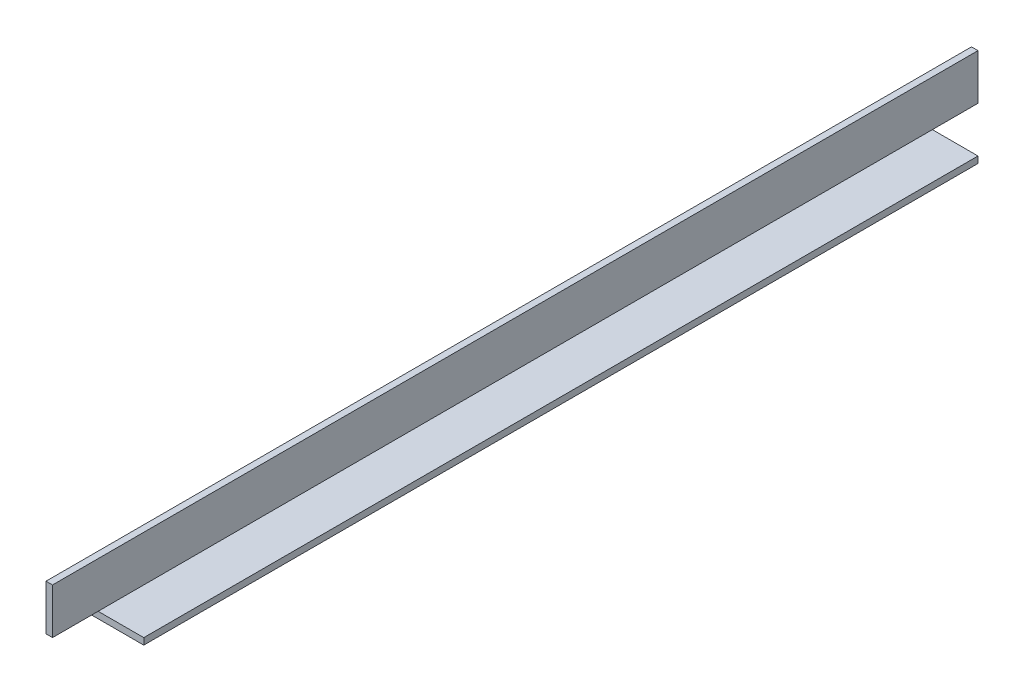
ISO-10303-21;
HEADER;
FILE_DESCRIPTION(('STEP AP214'),'2;1');
FILE_NAME('part.step','',(''),(''),'','','');
FILE_SCHEMA(('AUTOMOTIVE_DESIGN { 1 0 10303 214 1 1 1 1 }'));
ENDSEC;
DATA;
#1=APPLICATION_CONTEXT('core data for automotive mechanical design processes');
#2=APPLICATION_PROTOCOL_DEFINITION('international standard','automotive_design',2000,#1);
#3=PRODUCT_CONTEXT('',#1,'mechanical');
#4=PRODUCT('Part','Part','',(#3));
#5=PRODUCT_RELATED_PRODUCT_CATEGORY('part','',(#4));
#6=PRODUCT_DEFINITION_FORMATION('','',#4);
#7=PRODUCT_DEFINITION_CONTEXT('part definition',#1,'design');
#8=PRODUCT_DEFINITION('design','',#6,#7);
#9=PRODUCT_DEFINITION_SHAPE('','',#8);
#10=(LENGTH_UNIT() NAMED_UNIT(*) SI_UNIT(.MILLI.,.METRE.));
#11=(NAMED_UNIT(*) PLANE_ANGLE_UNIT() SI_UNIT($,.RADIAN.));
#12=(NAMED_UNIT(*) SI_UNIT($,.STERADIAN.) SOLID_ANGLE_UNIT());
#13=UNCERTAINTY_MEASURE_WITH_UNIT(LENGTH_MEASURE(1.E-05),#10,'distance_accuracy_value','');
#14=(GEOMETRIC_REPRESENTATION_CONTEXT(3) GLOBAL_UNCERTAINTY_ASSIGNED_CONTEXT((#13)) GLOBAL_UNIT_ASSIGNED_CONTEXT((#10,
#11,#12)) REPRESENTATION_CONTEXT('',''));
#15=CARTESIAN_POINT('',(0.,0.,0.));
#16=DIRECTION('',(0.,0.,1.));
#17=DIRECTION('',(1.,0.,0.));
#18=AXIS2_PLACEMENT_3D('',#15,#16,#17);
#19=CARTESIAN_POINT('',(25.4,0.,450.85));
#20=DIRECTION('',(0.,1.,0.));
#21=DIRECTION('',(0.,0.,1.));
#22=AXIS2_PLACEMENT_3D('',#19,#20,#21);
#23=PLANE('',#22);
#24=DIRECTION('',(0.,0.,-1.));
#25=VECTOR('',#24,1.);
#26=CARTESIAN_POINT('',(25.4,0.,450.85));
#27=LINE('',#26,#25);
#28=CARTESIAN_POINT('',(25.4,0.,428.625));
#29=VERTEX_POINT('',#28);
#30=CARTESIAN_POINT('',(25.4,0.,22.225));
#31=VERTEX_POINT('',#30);
#32=EDGE_CURVE('E11',#29,#31,#27,.T.);
#33=ORIENTED_EDGE('',*,*,#32,.F.);
#34=DIRECTION('',(1.,0.,0.));
#35=VECTOR('',#34,1.);
#36=CARTESIAN_POINT('',(0.,0.,428.625));
#37=LINE('',#36,#35);
#38=CARTESIAN_POINT('',(0.,0.,428.625));
#39=VERTEX_POINT('',#38);
#40=EDGE_CURVE('E123',#39,#29,#37,.T.);
#41=ORIENTED_EDGE('',*,*,#40,.F.);
#42=DIRECTION('',(0.,0.,-1.));
#43=VECTOR('',#42,1.);
#44=CARTESIAN_POINT('',(0.,0.,450.85));
#45=LINE('',#44,#43);
#46=CARTESIAN_POINT('',(0.,0.,22.225));
#47=VERTEX_POINT('',#46);
#48=EDGE_CURVE('E138',#39,#47,#45,.T.);
#49=ORIENTED_EDGE('',*,*,#48,.T.);
#50=DIRECTION('',(1.,0.,0.));
#51=VECTOR('',#50,1.);
#52=CARTESIAN_POINT('',(0.,0.,22.225));
#53=LINE('',#52,#51);
#54=EDGE_CURVE('E184',#47,#31,#53,.T.);
#55=ORIENTED_EDGE('',*,*,#54,.T.);
#56=EDGE_LOOP('',(#33,#41,#49,#55));
#57=FACE_BOUND('',#56,.T.);
#58=ADVANCED_FACE('F39',(#57),#23,.F.);
#59=CARTESIAN_POINT('',(25.4,3.175,450.85));
#60=DIRECTION('',(-1.,0.,0.));
#61=DIRECTION('',(0.,0.,1.));
#62=AXIS2_PLACEMENT_3D('',#59,#60,#61);
#63=PLANE('',#62);
#64=DIRECTION('',(0.,0.,-1.));
#65=VECTOR('',#64,1.);
#66=CARTESIAN_POINT('',(25.4,3.175,450.85));
#67=LINE('',#66,#65);
#68=CARTESIAN_POINT('',(25.4,3.175,428.625));
#69=VERTEX_POINT('',#68);
#70=CARTESIAN_POINT('',(25.4,3.175,22.225));
#71=VERTEX_POINT('',#70);
#72=EDGE_CURVE('E47',#69,#71,#67,.T.);
#73=ORIENTED_EDGE('',*,*,#72,.F.);
#74=DIRECTION('',(0.,1.,0.));
#75=VECTOR('',#74,1.);
#76=CARTESIAN_POINT('',(25.4,3.175,428.625));
#77=LINE('',#76,#75);
#78=EDGE_CURVE('E132',#29,#69,#77,.T.);
#79=ORIENTED_EDGE('',*,*,#78,.F.);
#80=ORIENTED_EDGE('',*,*,#32,.T.);
#81=DIRECTION('',(0.,-1.,0.));
#82=VECTOR('',#81,1.);
#83=CARTESIAN_POINT('',(25.4,3.175,22.225));
#84=LINE('',#83,#82);
#85=EDGE_CURVE('E176',#71,#31,#84,.T.);
#86=ORIENTED_EDGE('',*,*,#85,.F.);
#87=EDGE_LOOP('',(#73,#79,#80,#86));
#88=FACE_BOUND('',#87,.T.);
#89=ADVANCED_FACE('F175',(#88),#63,.F.);
#90=CARTESIAN_POINT('',(3.175,3.175,450.85));
#91=DIRECTION('',(0.,-1.,0.));
#92=DIRECTION('',(1.,0.,0.));
#93=AXIS2_PLACEMENT_3D('',#90,#91,#92);
#94=PLANE('',#93);
#95=DIRECTION('',(0.,0.,-1.));
#96=VECTOR('',#95,1.);
#97=CARTESIAN_POINT('',(3.175,3.175,450.85));
#98=LINE('',#97,#96);
#99=CARTESIAN_POINT('',(3.175,3.175,428.625));
#100=VERTEX_POINT('',#99);
#101=CARTESIAN_POINT('',(3.175,3.175,22.225));
#102=VERTEX_POINT('',#101);
#103=EDGE_CURVE('E161',#100,#102,#98,.T.);
#104=ORIENTED_EDGE('',*,*,#103,.F.);
#105=DIRECTION('',(1.,0.,0.));
#106=VECTOR('',#105,1.);
#107=CARTESIAN_POINT('',(0.,3.175,428.625));
#108=LINE('',#107,#106);
#109=EDGE_CURVE('E140',#100,#69,#108,.T.);
#110=ORIENTED_EDGE('',*,*,#109,.T.);
#111=ORIENTED_EDGE('',*,*,#72,.T.);
#112=DIRECTION('',(1.,0.,0.));
#113=VECTOR('',#112,1.);
#114=CARTESIAN_POINT('',(0.,3.175,22.225));
#115=LINE('',#114,#113);
#116=EDGE_CURVE('E171',#102,#71,#115,.T.);
#117=ORIENTED_EDGE('',*,*,#116,.F.);
#118=EDGE_LOOP('',(#104,#110,#111,#117));
#119=FACE_BOUND('',#118,.T.);
#120=ADVANCED_FACE('F170',(#119),#94,.F.);
#121=CARTESIAN_POINT('',(3.175,25.4,450.85));
#122=DIRECTION('',(-1.,0.,0.));
#123=DIRECTION('',(0.,-1.,0.));
#124=AXIS2_PLACEMENT_3D('',#121,#122,#123);
#125=PLANE('',#124);
#126=DIRECTION('',(0.,1.,0.));
#127=VECTOR('',#126,1.);
#128=CARTESIAN_POINT('',(3.175,25.4,0.));
#129=LINE('',#128,#127);
#130=CARTESIAN_POINT('',(3.175,3.175,0.));
#131=VERTEX_POINT('',#130);
#132=CARTESIAN_POINT('',(3.175,25.4,0.));
#133=VERTEX_POINT('',#132);
#134=EDGE_CURVE('E198',#131,#133,#129,.T.);
#135=ORIENTED_EDGE('',*,*,#134,.T.);
#136=DIRECTION('',(0.,0.,-1.));
#137=VECTOR('',#136,1.);
#138=CARTESIAN_POINT('',(3.175,25.4,450.85));
#139=LINE('',#138,#137);
#140=CARTESIAN_POINT('',(3.175,25.4,450.85));
#141=VERTEX_POINT('',#140);
#142=EDGE_CURVE('E152',#141,#133,#139,.T.);
#143=ORIENTED_EDGE('',*,*,#142,.F.);
#144=DIRECTION('',(0.,1.,0.));
#145=VECTOR('',#144,1.);
#146=CARTESIAN_POINT('',(3.175,25.4,450.85));
#147=LINE('',#146,#145);
#148=CARTESIAN_POINT('',(3.175,3.175,450.85));
#149=VERTEX_POINT('',#148);
#150=EDGE_CURVE('E200',#149,#141,#147,.T.);
#151=ORIENTED_EDGE('',*,*,#150,.F.);
#152=EDGE_CURVE('E84',#149,#100,#98,.T.);
#153=ORIENTED_EDGE('',*,*,#152,.T.);
#154=ORIENTED_EDGE('',*,*,#103,.T.);
#155=DIRECTION('',(0.,0.,-1.));
#156=VECTOR('',#155,1.);
#157=CARTESIAN_POINT('',(3.175,3.17500000000002,450.85));
#158=LINE('',#157,#156);
#159=EDGE_CURVE('E194',#102,#131,#158,.T.);
#160=ORIENTED_EDGE('',*,*,#159,.T.);
#161=EDGE_LOOP('',(#135,#143,#151,#153,#154,#160));
#162=FACE_BOUND('',#161,.T.);
#163=ADVANCED_FACE('F216',(#162),#125,.F.);
#164=CARTESIAN_POINT('',(0.,25.4,450.85));
#165=DIRECTION('',(0.,-1.,0.));
#166=DIRECTION('',(0.,0.,-1.));
#167=AXIS2_PLACEMENT_3D('',#164,#165,#166);
#168=PLANE('',#167);
#169=DIRECTION('',(-1.,0.,0.));
#170=VECTOR('',#169,1.);
#171=CARTESIAN_POINT('',(0.,25.4,0.));
#172=LINE('',#171,#170);
#173=CARTESIAN_POINT('',(0.,25.4,0.));
#174=VERTEX_POINT('',#173);
#175=EDGE_CURVE('E77',#133,#174,#172,.T.);
#176=ORIENTED_EDGE('',*,*,#175,.T.);
#177=DIRECTION('',(0.,0.,-1.));
#178=VECTOR('',#177,1.);
#179=CARTESIAN_POINT('',(0.,25.4,450.85));
#180=LINE('',#179,#178);
#181=CARTESIAN_POINT('',(0.,25.4,450.85));
#182=VERTEX_POINT('',#181);
#183=EDGE_CURVE('E147',#182,#174,#180,.T.);
#184=ORIENTED_EDGE('',*,*,#183,.F.);
#185=DIRECTION('',(-1.,0.,0.));
#186=VECTOR('',#185,1.);
#187=CARTESIAN_POINT('',(0.,25.4,450.85));
#188=LINE('',#187,#186);
#189=EDGE_CURVE('E63',#141,#182,#188,.T.);
#190=ORIENTED_EDGE('',*,*,#189,.F.);
#191=ORIENTED_EDGE('',*,*,#142,.T.);
#192=EDGE_LOOP('',(#176,#184,#190,#191));
#193=FACE_BOUND('',#192,.T.);
#194=ADVANCED_FACE('F250',(#193),#168,.F.);
#195=CARTESIAN_POINT('',(0.,0.,450.85));
#196=DIRECTION('',(1.,0.,0.));
#197=DIRECTION('',(0.,0.,-1.));
#198=AXIS2_PLACEMENT_3D('',#195,#196,#197);
#199=PLANE('',#198);
#200=DIRECTION('',(0.,1.,0.));
#201=VECTOR('',#200,1.);
#202=CARTESIAN_POINT('',(0.,3.175,428.625));
#203=LINE('',#202,#201);
#204=CARTESIAN_POINT('',(0.,3.175,428.625));
#205=VERTEX_POINT('',#204);
#206=EDGE_CURVE('E120',#39,#205,#203,.T.);
#207=ORIENTED_EDGE('',*,*,#206,.T.);
#208=DIRECTION('',(0.,0.,1.));
#209=VECTOR('',#208,1.);
#210=CARTESIAN_POINT('',(0.,3.175,450.85));
#211=LINE('',#210,#209);
#212=CARTESIAN_POINT('',(0.,3.175,450.85));
#213=VERTEX_POINT('',#212);
#214=EDGE_CURVE('E131',#205,#213,#211,.T.);
#215=ORIENTED_EDGE('',*,*,#214,.T.);
#216=DIRECTION('',(0.,-1.,0.));
#217=VECTOR('',#216,1.);
#218=CARTESIAN_POINT('',(0.,0.,450.85));
#219=LINE('',#218,#217);
#220=EDGE_CURVE('E148',#182,#213,#219,.T.);
#221=ORIENTED_EDGE('',*,*,#220,.F.);
#222=ORIENTED_EDGE('',*,*,#183,.T.);
#223=DIRECTION('',(0.,-1.,0.));
#224=VECTOR('',#223,1.);
#225=CARTESIAN_POINT('',(0.,0.,0.));
#226=LINE('',#225,#224);
#227=CARTESIAN_POINT('',(0.,3.175,0.));
#228=VERTEX_POINT('',#227);
#229=EDGE_CURVE('E156',#174,#228,#226,.T.);
#230=ORIENTED_EDGE('',*,*,#229,.T.);
#231=DIRECTION('',(0.,0.,1.));
#232=VECTOR('',#231,1.);
#233=CARTESIAN_POINT('',(0.,3.175,0.));
#234=LINE('',#233,#232);
#235=CARTESIAN_POINT('',(0.,3.175,22.225));
#236=VERTEX_POINT('',#235);
#237=EDGE_CURVE('E54',#228,#236,#234,.T.);
#238=ORIENTED_EDGE('',*,*,#237,.T.);
#239=DIRECTION('',(0.,-1.,0.));
#240=VECTOR('',#239,1.);
#241=CARTESIAN_POINT('',(0.,3.175,22.225));
#242=LINE('',#241,#240);
#243=EDGE_CURVE('E145',#236,#47,#242,.T.);
#244=ORIENTED_EDGE('',*,*,#243,.T.);
#245=ORIENTED_EDGE('',*,*,#48,.F.);
#246=EDGE_LOOP('',(#207,#215,#221,#222,#230,#238,#244,#245));
#247=FACE_BOUND('',#246,.T.);
#248=ADVANCED_FACE('F143',(#247),#199,.F.);
#249=CARTESIAN_POINT('',(0.,0.,450.85));
#250=DIRECTION('',(0.,0.,-1.));
#251=DIRECTION('',(-1.,0.,0.));
#252=AXIS2_PLACEMENT_3D('',#249,#250,#251);
#253=PLANE('',#252);
#254=ORIENTED_EDGE('',*,*,#220,.T.);
#255=DIRECTION('',(1.,0.,0.));
#256=VECTOR('',#255,1.);
#257=CARTESIAN_POINT('',(0.,3.175,450.85));
#258=LINE('',#257,#256);
#259=EDGE_CURVE('E199',#213,#149,#258,.T.);
#260=ORIENTED_EDGE('',*,*,#259,.T.);
#261=ORIENTED_EDGE('',*,*,#150,.T.);
#262=ORIENTED_EDGE('',*,*,#189,.T.);
#263=EDGE_LOOP('',(#254,#260,#261,#262));
#264=FACE_BOUND('',#263,.T.);
#265=ADVANCED_FACE('F220',(#264),#253,.F.);
#266=CARTESIAN_POINT('',(0.,0.,0.));
#267=DIRECTION('',(0.,0.,-1.));
#268=DIRECTION('',(-1.,0.,0.));
#269=AXIS2_PLACEMENT_3D('',#266,#267,#268);
#270=PLANE('',#269);
#271=DIRECTION('',(1.,0.,0.));
#272=VECTOR('',#271,1.);
#273=CARTESIAN_POINT('',(0.,3.175,0.));
#274=LINE('',#273,#272);
#275=EDGE_CURVE('E191',#228,#131,#274,.T.);
#276=ORIENTED_EDGE('',*,*,#275,.F.);
#277=ORIENTED_EDGE('',*,*,#229,.F.);
#278=ORIENTED_EDGE('',*,*,#175,.F.);
#279=ORIENTED_EDGE('',*,*,#134,.F.);
#280=EDGE_LOOP('',(#276,#277,#278,#279));
#281=FACE_BOUND('',#280,.T.);
#282=ADVANCED_FACE('F212',(#281),#270,.T.);
#283=CARTESIAN_POINT('',(0.,3.175,0.));
#284=DIRECTION('',(0.,1.,0.));
#285=DIRECTION('',(0.,0.,1.));
#286=AXIS2_PLACEMENT_3D('',#283,#284,#285);
#287=PLANE('',#286);
#288=EDGE_CURVE('E187',#236,#102,#115,.T.);
#289=ORIENTED_EDGE('',*,*,#288,.F.);
#290=ORIENTED_EDGE('',*,*,#237,.F.);
#291=ORIENTED_EDGE('',*,*,#275,.T.);
#292=ORIENTED_EDGE('',*,*,#159,.F.);
#293=EDGE_LOOP('',(#289,#290,#291,#292));
#294=FACE_BOUND('',#293,.T.);
#295=ADVANCED_FACE('F214',(#294),#287,.F.);
#296=CARTESIAN_POINT('',(0.,3.175,22.225));
#297=DIRECTION('',(0.,0.,1.));
#298=DIRECTION('',(0.,-1.,0.));
#299=AXIS2_PLACEMENT_3D('',#296,#297,#298);
#300=PLANE('',#299);
#301=ORIENTED_EDGE('',*,*,#85,.T.);
#302=ORIENTED_EDGE('',*,*,#54,.F.);
#303=ORIENTED_EDGE('',*,*,#243,.F.);
#304=ORIENTED_EDGE('',*,*,#288,.T.);
#305=ORIENTED_EDGE('',*,*,#116,.T.);
#306=EDGE_LOOP('',(#301,#302,#303,#304,#305));
#307=FACE_BOUND('',#306,.T.);
#308=ADVANCED_FACE('F231',(#307),#300,.F.);
#309=CARTESIAN_POINT('',(0.,3.175,450.85));
#310=DIRECTION('',(0.,1.,0.));
#311=DIRECTION('',(0.,0.,1.));
#312=AXIS2_PLACEMENT_3D('',#309,#310,#311);
#313=PLANE('',#312);
#314=ORIENTED_EDGE('',*,*,#259,.F.);
#315=ORIENTED_EDGE('',*,*,#214,.F.);
#316=EDGE_CURVE('E125',#205,#100,#108,.T.);
#317=ORIENTED_EDGE('',*,*,#316,.T.);
#318=ORIENTED_EDGE('',*,*,#152,.F.);
#319=EDGE_LOOP('',(#314,#315,#317,#318));
#320=FACE_BOUND('',#319,.T.);
#321=ADVANCED_FACE('F229',(#320),#313,.F.);
#322=CARTESIAN_POINT('',(0.,3.175,428.625));
#323=DIRECTION('',(0.,0.,-1.));
#324=DIRECTION('',(-1.,0.,0.));
#325=AXIS2_PLACEMENT_3D('',#322,#323,#324);
#326=PLANE('',#325);
#327=ORIENTED_EDGE('',*,*,#78,.T.);
#328=ORIENTED_EDGE('',*,*,#109,.F.);
#329=ORIENTED_EDGE('',*,*,#316,.F.);
#330=ORIENTED_EDGE('',*,*,#206,.F.);
#331=ORIENTED_EDGE('',*,*,#40,.T.);
#332=EDGE_LOOP('',(#327,#328,#329,#330,#331));
#333=FACE_BOUND('',#332,.T.);
#334=ADVANCED_FACE('F122',(#333),#326,.F.);
#335=CLOSED_SHELL('',(#58,#89,#120,#163,#194,#248,#265,#282,#295,#308,#321,#334));
#336=MANIFOLD_SOLID_BREP('B2',#335);
#337=ADVANCED_BREP_SHAPE_REPRESENTATION('',(#18,#336),#14);
#338=SHAPE_DEFINITION_REPRESENTATION(#9,#337);
ENDSEC;
END-ISO-10303-21;
